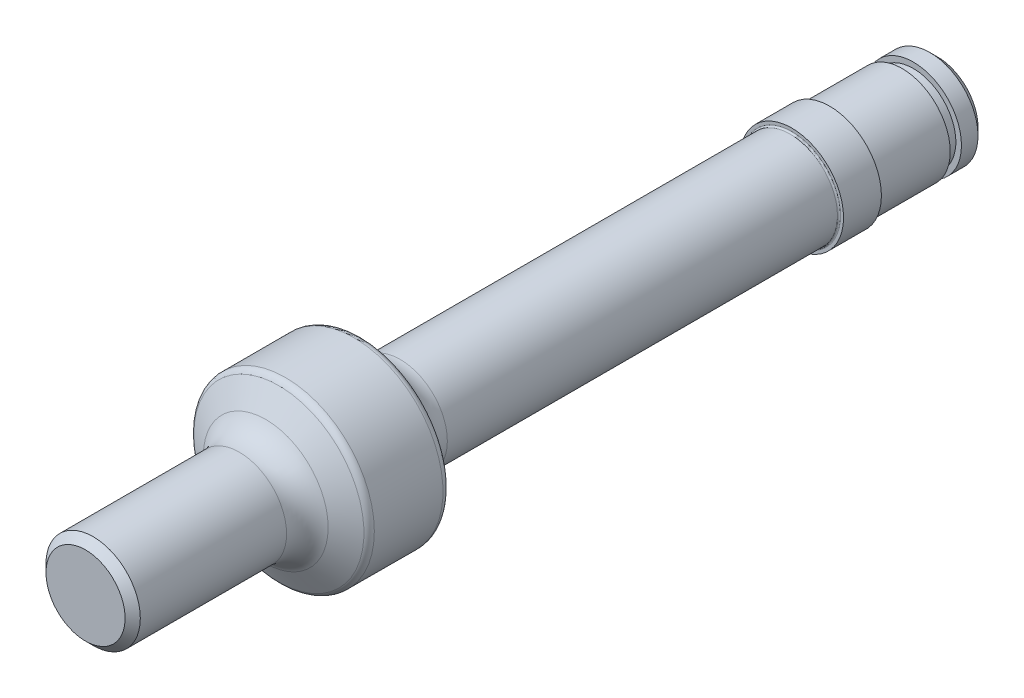
ISO-10303-21;
HEADER;
FILE_DESCRIPTION(('STEP AP214'),'2;1');
FILE_NAME('part.step','',(''),(''),'','','');
FILE_SCHEMA(('AUTOMOTIVE_DESIGN { 1 0 10303 214 1 1 1 1 }'));
ENDSEC;
DATA;
#1=APPLICATION_CONTEXT('core data for automotive mechanical design processes');
#2=APPLICATION_PROTOCOL_DEFINITION('international standard','automotive_design',2000,#1);
#3=PRODUCT_CONTEXT('',#1,'mechanical');
#4=PRODUCT('Part','Part','',(#3));
#5=PRODUCT_RELATED_PRODUCT_CATEGORY('part','',(#4));
#6=PRODUCT_DEFINITION_FORMATION('','',#4);
#7=PRODUCT_DEFINITION_CONTEXT('part definition',#1,'design');
#8=PRODUCT_DEFINITION('design','',#6,#7);
#9=PRODUCT_DEFINITION_SHAPE('','',#8);
#10=(LENGTH_UNIT() NAMED_UNIT(*) SI_UNIT(.MILLI.,.METRE.));
#11=(NAMED_UNIT(*) PLANE_ANGLE_UNIT() SI_UNIT($,.RADIAN.));
#12=(NAMED_UNIT(*) SI_UNIT($,.STERADIAN.) SOLID_ANGLE_UNIT());
#13=UNCERTAINTY_MEASURE_WITH_UNIT(LENGTH_MEASURE(1.E-05),#10,'distance_accuracy_value','');
#14=(GEOMETRIC_REPRESENTATION_CONTEXT(3) GLOBAL_UNCERTAINTY_ASSIGNED_CONTEXT((#13)) GLOBAL_UNIT_ASSIGNED_CONTEXT((#10,
#11,#12)) REPRESENTATION_CONTEXT('',''));
#15=CARTESIAN_POINT('',(0.,0.,0.));
#16=DIRECTION('',(0.,0.,1.));
#17=DIRECTION('',(1.,0.,0.));
#18=AXIS2_PLACEMENT_3D('',#15,#16,#17);
#19=CARTESIAN_POINT('',(0.,3.1623,-40.6019));
#20=DIRECTION('',(0.,0.,1.));
#21=DIRECTION('',(1.,0.,0.));
#22=AXIS2_PLACEMENT_3D('',#19,#20,#21);
#23=PLANE('',#22);
#24=CARTESIAN_POINT('',(0.,0.,-40.6019000000697));
#25=DIRECTION('',(0.,0.,1.));
#26=DIRECTION('',(1.,0.,0.));
#27=AXIS2_PLACEMENT_3D('',#24,#25,#26);
#28=CIRCLE('',#27,2.66229999999723);
#29=CARTESIAN_POINT('',(2.66229999999723,0.,-40.6019000000697));
#30=VERTEX_POINT('',#29);
#31=EDGE_CURVE('E258',#30,#30,#28,.T.);
#32=ORIENTED_EDGE('',*,*,#31,.F.);
#33=EDGE_LOOP('',(#32));
#34=FACE_BOUND('',#33,.T.);
#35=ADVANCED_FACE('F18',(#34),#23,.F.);
#36=CARTESIAN_POINT('',(0.,0.,-40.1019000000247));
#37=DIRECTION('',(0.,0.,1.));
#38=DIRECTION('',(1.,0.,0.));
#39=AXIS2_PLACEMENT_3D('',#36,#37,#38);
#40=CONICAL_SURFACE('',#39,3.16230000004225,0.785398163397448);
#41=ORIENTED_EDGE('',*,*,#31,.T.);
#42=EDGE_LOOP('',(#41));
#43=FACE_BOUND('',#42,.T.);
#44=CARTESIAN_POINT('',(0.,0.,-40.1019));
#45=DIRECTION('',(0.,0.,1.));
#46=DIRECTION('',(1.,0.,0.));
#47=AXIS2_PLACEMENT_3D('',#44,#45,#46);
#48=CIRCLE('',#47,3.1623);
#49=CARTESIAN_POINT('',(3.1623,0.,-40.1019));
#50=VERTEX_POINT('',#49);
#51=EDGE_CURVE('E257',#50,#50,#48,.T.);
#52=ORIENTED_EDGE('',*,*,#51,.F.);
#53=EDGE_LOOP('',(#52));
#54=FACE_BOUND('',#53,.T.);
#55=ADVANCED_FACE('F150',(#43,#54),#40,.T.);
#56=CARTESIAN_POINT('',(0.,0.,26.453846));
#57=DIRECTION('',(0.,0.,1.));
#58=DIRECTION('',(1.,0.,0.));
#59=AXIS2_PLACEMENT_3D('',#56,#57,#58);
#60=CYLINDRICAL_SURFACE('',#59,3.1623);
#61=ORIENTED_EDGE('',*,*,#51,.T.);
#62=EDGE_LOOP('',(#61));
#63=FACE_BOUND('',#62,.T.);
#64=CARTESIAN_POINT('',(0.,0.,-39.0144));
#65=DIRECTION('',(0.,0.,1.));
#66=DIRECTION('',(1.,0.,0.));
#67=AXIS2_PLACEMENT_3D('',#64,#65,#66);
#68=CIRCLE('',#67,3.1623);
#69=CARTESIAN_POINT('',(3.1623,0.,-39.0144));
#70=VERTEX_POINT('',#69);
#71=EDGE_CURVE('E254',#70,#70,#68,.F.);
#72=ORIENTED_EDGE('',*,*,#71,.T.);
#73=EDGE_LOOP('',(#72));
#74=FACE_BOUND('',#73,.T.);
#75=ADVANCED_FACE('F147',(#63,#74),#60,.T.);
#76=CARTESIAN_POINT('',(0.,3.10000000000002,15.3981));
#77=DIRECTION('',(0.,0.,-1.));
#78=DIRECTION('',(-1.,0.,0.));
#79=AXIS2_PLACEMENT_3D('',#76,#77,#78);
#80=PLANE('',#79);
#81=CARTESIAN_POINT('',(0.,0.,15.3980999999703));
#82=DIRECTION('',(0.,0.,-1.));
#83=DIRECTION('',(0.,1.,0.));
#84=AXIS2_PLACEMENT_3D('',#81,#82,#83);
#85=CIRCLE('',#84,2.59999999991578);
#86=CARTESIAN_POINT('',(0.,2.59999999991578,15.3980999999703));
#87=VERTEX_POINT('',#86);
#88=EDGE_CURVE('E251',#87,#87,#85,.T.);
#89=ORIENTED_EDGE('',*,*,#88,.F.);
#90=EDGE_LOOP('',(#89));
#91=FACE_BOUND('',#90,.T.);
#92=ADVANCED_FACE('F143',(#91),#80,.F.);
#93=CARTESIAN_POINT('',(0.,2.794,-39.0144));
#94=DIRECTION('',(0.,0.,-1.));
#95=DIRECTION('',(-1.,0.,0.));
#96=AXIS2_PLACEMENT_3D('',#93,#94,#95);
#97=PLANE('',#96);
#98=CARTESIAN_POINT('',(0.,0.,-39.0144));
#99=DIRECTION('',(0.,0.,-1.));
#100=DIRECTION('',(-1.,0.,0.));
#101=AXIS2_PLACEMENT_3D('',#98,#99,#100);
#102=CIRCLE('',#101,2.794);
#103=CARTESIAN_POINT('',(-2.794,0.,-39.0144));
#104=VERTEX_POINT('',#103);
#105=EDGE_CURVE('E248',#104,#104,#102,.F.);
#106=ORIENTED_EDGE('',*,*,#105,.F.);
#107=EDGE_LOOP('',(#106));
#108=FACE_BOUND('',#107,.T.);
#109=ORIENTED_EDGE('',*,*,#71,.F.);
#110=EDGE_LOOP('',(#109));
#111=FACE_BOUND('',#110,.T.);
#112=ADVANCED_FACE('F139',(#108,#111),#97,.F.);
#113=CARTESIAN_POINT('',(0.,0.,14.8980999999822));
#114=DIRECTION('',(0.,0.,-1.));
#115=DIRECTION('',(0.,1.,0.));
#116=AXIS2_PLACEMENT_3D('',#113,#114,#115);
#117=CONICAL_SURFACE('',#116,3.0999999999608,0.785398163454292);
#118=ORIENTED_EDGE('',*,*,#88,.T.);
#119=EDGE_LOOP('',(#118));
#120=FACE_BOUND('',#119,.T.);
#121=CARTESIAN_POINT('',(0.,0.,14.8981));
#122=DIRECTION('',(0.,0.,1.));
#123=DIRECTION('',(1.,0.,0.));
#124=AXIS2_PLACEMENT_3D('',#121,#122,#123);
#125=CIRCLE('',#124,3.10000000000001);
#126=CARTESIAN_POINT('',(3.10000000000001,0.,14.8981));
#127=VERTEX_POINT('',#126);
#128=EDGE_CURVE('E247',#127,#127,#125,.F.);
#129=ORIENTED_EDGE('',*,*,#128,.F.);
#130=EDGE_LOOP('',(#129));
#131=FACE_BOUND('',#130,.T.);
#132=ADVANCED_FACE('F135',(#120,#131),#117,.T.);
#133=CARTESIAN_POINT('',(0.,0.,-40.0654390361338));
#134=DIRECTION('',(0.,0.,-1.));
#135=DIRECTION('',(-1.,0.,0.));
#136=AXIS2_PLACEMENT_3D('',#133,#134,#135);
#137=CYLINDRICAL_SURFACE('',#136,2.794);
#138=ORIENTED_EDGE('',*,*,#105,.T.);
#139=EDGE_LOOP('',(#138));
#140=FACE_BOUND('',#139,.T.);
#141=CARTESIAN_POINT('',(0.,0.,-38.2778));
#142=DIRECTION('',(0.,0.,-1.));
#143=DIRECTION('',(-1.,0.,0.));
#144=AXIS2_PLACEMENT_3D('',#141,#142,#143);
#145=CIRCLE('',#144,2.794);
#146=CARTESIAN_POINT('',(-2.794,0.,-38.2778));
#147=VERTEX_POINT('',#146);
#148=EDGE_CURVE('E244',#147,#147,#145,.T.);
#149=ORIENTED_EDGE('',*,*,#148,.T.);
#150=EDGE_LOOP('',(#149));
#151=FACE_BOUND('',#150,.T.);
#152=ADVANCED_FACE('F131',(#140,#151),#137,.T.);
#153=CARTESIAN_POINT('',(0.,0.,26.453846));
#154=DIRECTION('',(0.,0.,1.));
#155=DIRECTION('',(1.,0.,0.));
#156=AXIS2_PLACEMENT_3D('',#153,#154,#155);
#157=CYLINDRICAL_SURFACE('',#156,3.10000000000001);
#158=CARTESIAN_POINT('',(0.,0.,5.28374149423676));
#159=DIRECTION('',(0.,0.,1.));
#160=DIRECTION('',(1.,0.,0.));
#161=AXIS2_PLACEMENT_3D('',#158,#159,#160);
#162=CIRCLE('',#161,3.10000000000001);
#163=CARTESIAN_POINT('',(3.10000000000001,0.,5.28374149423676));
#164=VERTEX_POINT('',#163);
#165=EDGE_CURVE('E116',#164,#164,#162,.T.);
#166=ORIENTED_EDGE('',*,*,#165,.T.);
#167=EDGE_LOOP('',(#166));
#168=FACE_BOUND('',#167,.T.);
#169=ORIENTED_EDGE('',*,*,#128,.T.);
#170=EDGE_LOOP('',(#169));
#171=FACE_BOUND('',#170,.T.);
#172=ADVANCED_FACE('F127',(#168,#171),#157,.T.);
#173=CARTESIAN_POINT('',(0.,2.794,-38.2778));
#174=DIRECTION('',(0.,0.,1.));
#175=DIRECTION('',(1.,0.,0.));
#176=AXIS2_PLACEMENT_3D('',#173,#174,#175);
#177=PLANE('',#176);
#178=CARTESIAN_POINT('',(0.,0.,-38.2778));
#179=DIRECTION('',(0.,0.,1.));
#180=DIRECTION('',(1.,0.,0.));
#181=AXIS2_PLACEMENT_3D('',#178,#179,#180);
#182=CIRCLE('',#181,3.1623);
#183=CARTESIAN_POINT('',(3.1623,0.,-38.2778));
#184=VERTEX_POINT('',#183);
#185=EDGE_CURVE('E111',#184,#184,#182,.T.);
#186=ORIENTED_EDGE('',*,*,#185,.F.);
#187=EDGE_LOOP('',(#186));
#188=FACE_BOUND('',#187,.T.);
#189=ORIENTED_EDGE('',*,*,#148,.F.);
#190=EDGE_LOOP('',(#189));
#191=FACE_BOUND('',#190,.T.);
#192=ADVANCED_FACE('F123',(#188,#191),#177,.F.);
#193=CARTESIAN_POINT('',(0.,0.,5.28374149423676));
#194=DIRECTION('',(0.,0.,1.));
#195=DIRECTION('',(1.,0.,0.));
#196=AXIS2_PLACEMENT_3D('',#193,#194,#195);
#197=TOROIDAL_SURFACE('',#196,5.10000000000001,2.);
#198=CARTESIAN_POINT('',(0.,0.,3.55169068666328));
#199=DIRECTION('',(0.,0.,-1.));
#200=DIRECTION('',(-1.,0.,0.));
#201=AXIS2_PLACEMENT_3D('',#198,#199,#200);
#202=CIRCLE('',#201,4.099999999994);
#203=CARTESIAN_POINT('',(-4.099999999994,0.,3.55169068666328));
#204=VERTEX_POINT('',#203);
#205=EDGE_CURVE('E103',#204,#204,#202,.T.);
#206=ORIENTED_EDGE('',*,*,#205,.F.);
#207=EDGE_LOOP('',(#206));
#208=FACE_BOUND('',#207,.T.);
#209=ORIENTED_EDGE('',*,*,#165,.F.);
#210=EDGE_LOOP('',(#209));
#211=FACE_BOUND('',#210,.T.);
#212=ADVANCED_FACE('F119',(#208,#211),#197,.F.);
#213=CARTESIAN_POINT('',(0.,0.,26.453846));
#214=DIRECTION('',(0.,0.,1.));
#215=DIRECTION('',(1.,0.,0.));
#216=AXIS2_PLACEMENT_3D('',#213,#214,#215);
#217=CYLINDRICAL_SURFACE('',#216,3.1623);
#218=CARTESIAN_POINT('',(0.,0.,-33.6153));
#219=DIRECTION('',(0.,0.,1.));
#220=DIRECTION('',(1.,0.,0.));
#221=AXIS2_PLACEMENT_3D('',#218,#219,#220);
#222=CIRCLE('',#221,3.1623);
#223=CARTESIAN_POINT('',(3.1623,0.,-33.6153));
#224=VERTEX_POINT('',#223);
#225=EDGE_CURVE('E92',#224,#224,#222,.F.);
#226=ORIENTED_EDGE('',*,*,#225,.T.);
#227=EDGE_LOOP('',(#226));
#228=FACE_BOUND('',#227,.T.);
#229=ORIENTED_EDGE('',*,*,#185,.T.);
#230=EDGE_LOOP('',(#229));
#231=FACE_BOUND('',#230,.T.);
#232=ADVANCED_FACE('F122',(#228,#231),#217,.T.);
#233=CARTESIAN_POINT('',(0.,0.,2.69028408501981));
#234=DIRECTION('',(0.,0.,-1.));
#235=DIRECTION('',(-1.,0.,0.));
#236=AXIS2_PLACEMENT_3D('',#233,#234,#235);
#237=CONICAL_SURFACE('',#236,5.59199999997873,1.04719755118586);
#238=ORIENTED_EDGE('',*,*,#205,.T.);
#239=EDGE_LOOP('',(#238));
#240=FACE_BOUND('',#239,.T.);
#241=CARTESIAN_POINT('',(0.,0.,2.69028408503697));
#242=DIRECTION('',(0.,0.,-1.));
#243=DIRECTION('',(-1.,0.,0.));
#244=AXIS2_PLACEMENT_3D('',#241,#242,#243);
#245=CIRCLE('',#244,5.59199999999999);
#246=CARTESIAN_POINT('',(-5.59199999999999,0.,2.69028408503697));
#247=VERTEX_POINT('',#246);
#248=EDGE_CURVE('E59',#247,#247,#245,.T.);
#249=ORIENTED_EDGE('',*,*,#248,.F.);
#250=EDGE_LOOP('',(#249));
#251=FACE_BOUND('',#250,.T.);
#252=ADVANCED_FACE('F97',(#240,#251),#237,.T.);
#253=CARTESIAN_POINT('',(0.,0.,-33.6153));
#254=DIRECTION('',(0.,0.,1.));
#255=DIRECTION('',(1.,0.,0.));
#256=AXIS2_PLACEMENT_3D('',#253,#254,#255);
#257=TOROIDAL_SURFACE('',#256,3.2623,0.1);
#258=CARTESIAN_POINT('',(0.,0.,-33.5153));
#259=DIRECTION('',(0.,0.,-1.));
#260=DIRECTION('',(-1.,0.,0.));
#261=AXIS2_PLACEMENT_3D('',#258,#259,#260);
#262=CIRCLE('',#261,3.2623);
#263=CARTESIAN_POINT('',(-3.2623,0.,-33.5153));
#264=VERTEX_POINT('',#263);
#265=CARTESIAN_POINT('',(3.2623,0.,-33.5153));
#266=VERTEX_POINT('',#265);
#267=EDGE_CURVE('E48',#264,#266,#262,.T.);
#268=ORIENTED_EDGE('',*,*,#267,.T.);
#269=CARTESIAN_POINT('',(0.,0.,-33.5153));
#270=DIRECTION('',(0.,0.,-1.));
#271=DIRECTION('',(1.,0.,0.));
#272=AXIS2_PLACEMENT_3D('',#269,#270,#271);
#273=CIRCLE('',#272,3.2623);
#274=EDGE_CURVE('E46',#266,#264,#273,.T.);
#275=ORIENTED_EDGE('',*,*,#274,.T.);
#276=EDGE_LOOP('',(#268,#275));
#277=FACE_BOUND('',#276,.T.);
#278=ORIENTED_EDGE('',*,*,#225,.F.);
#279=EDGE_LOOP('',(#278));
#280=FACE_BOUND('',#279,.T.);
#281=ADVANCED_FACE('F50',(#277,#280),#257,.F.);
#282=CARTESIAN_POINT('',(0.,0.,2.25727138314476));
#283=DIRECTION('',(0.,0.,-1.));
#284=DIRECTION('',(-1.,0.,0.));
#285=AXIS2_PLACEMENT_3D('',#282,#283,#284);
#286=TOROIDAL_SURFACE('',#285,5.34199999999999,0.5);
#287=ORIENTED_EDGE('',*,*,#248,.T.);
#288=EDGE_LOOP('',(#287));
#289=FACE_BOUND('',#288,.T.);
#290=CARTESIAN_POINT('',(0.,0.,2.25727138314476));
#291=DIRECTION('',(0.,0.,1.));
#292=DIRECTION('',(1.,0.,0.));
#293=AXIS2_PLACEMENT_3D('',#290,#291,#292);
#294=CIRCLE('',#293,5.842);
#295=CARTESIAN_POINT('',(5.842,0.,2.25727138314476));
#296=VERTEX_POINT('',#295);
#297=EDGE_CURVE('E54',#296,#296,#294,.F.);
#298=ORIENTED_EDGE('',*,*,#297,.F.);
#299=EDGE_LOOP('',(#298));
#300=FACE_BOUND('',#299,.T.);
#301=ADVANCED_FACE('F77',(#289,#300),#286,.T.);
#302=CARTESIAN_POINT('',(0.,3.4,-33.5153));
#303=DIRECTION('',(0.,0.,1.));
#304=DIRECTION('',(1.,0.,0.));
#305=AXIS2_PLACEMENT_3D('',#302,#303,#304);
#306=PLANE('',#305);
#307=CARTESIAN_POINT('',(0.,0.,-33.5153));
#308=DIRECTION('',(0.,0.,1.));
#309=DIRECTION('',(1.,0.,0.));
#310=AXIS2_PLACEMENT_3D('',#307,#308,#309);
#311=CIRCLE('',#310,3.4);
#312=CARTESIAN_POINT('',(3.4,0.,-33.5153));
#313=VERTEX_POINT('',#312);
#314=EDGE_CURVE('E230',#313,#313,#311,.T.);
#315=ORIENTED_EDGE('',*,*,#314,.F.);
#316=EDGE_LOOP('',(#315));
#317=FACE_BOUND('',#316,.T.);
#318=ORIENTED_EDGE('',*,*,#274,.F.);
#319=ORIENTED_EDGE('',*,*,#267,.F.);
#320=EDGE_LOOP('',(#318,#319));
#321=FACE_BOUND('',#320,.T.);
#322=ADVANCED_FACE('F58',(#317,#321),#306,.F.);
#323=CARTESIAN_POINT('',(0.,0.,26.453846));
#324=DIRECTION('',(0.,0.,1.));
#325=DIRECTION('',(1.,0.,0.));
#326=AXIS2_PLACEMENT_3D('',#323,#324,#325);
#327=CYLINDRICAL_SURFACE('',#326,5.842);
#328=CARTESIAN_POINT('',(0.,0.,-2.25727138314476));
#329=DIRECTION('',(0.,0.,-1.));
#330=DIRECTION('',(-1.,0.,0.));
#331=AXIS2_PLACEMENT_3D('',#328,#329,#330);
#332=CIRCLE('',#331,5.842);
#333=CARTESIAN_POINT('',(-5.842,0.,-2.25727138314476));
#334=VERTEX_POINT('',#333);
#335=EDGE_CURVE('E227',#334,#334,#332,.T.);
#336=ORIENTED_EDGE('',*,*,#335,.F.);
#337=EDGE_LOOP('',(#336));
#338=FACE_BOUND('',#337,.T.);
#339=ORIENTED_EDGE('',*,*,#297,.T.);
#340=EDGE_LOOP('',(#339));
#341=FACE_BOUND('',#340,.T.);
#342=ADVANCED_FACE('F76',(#338,#341),#327,.T.);
#343=CARTESIAN_POINT('',(0.,0.,26.453846));
#344=DIRECTION('',(0.,0.,1.));
#345=DIRECTION('',(1.,0.,0.));
#346=AXIS2_PLACEMENT_3D('',#343,#344,#345);
#347=CYLINDRICAL_SURFACE('',#346,3.4);
#348=CARTESIAN_POINT('',(0.,0.,-31.0261));
#349=DIRECTION('',(0.,0.,1.));
#350=DIRECTION('',(1.,0.,0.));
#351=AXIS2_PLACEMENT_3D('',#348,#349,#350);
#352=CIRCLE('',#351,3.4);
#353=CARTESIAN_POINT('',(3.4,0.,-31.0261));
#354=VERTEX_POINT('',#353);
#355=EDGE_CURVE('E229',#354,#354,#352,.F.);
#356=ORIENTED_EDGE('',*,*,#355,.T.);
#357=EDGE_LOOP('',(#356));
#358=FACE_BOUND('',#357,.T.);
#359=ORIENTED_EDGE('',*,*,#314,.T.);
#360=EDGE_LOOP('',(#359));
#361=FACE_BOUND('',#360,.T.);
#362=ADVANCED_FACE('F282',(#358,#361),#347,.T.);
#363=CARTESIAN_POINT('',(0.,0.,-2.25727138314476));
#364=DIRECTION('',(0.,0.,-1.));
#365=DIRECTION('',(-1.,0.,0.));
#366=AXIS2_PLACEMENT_3D('',#363,#364,#365);
#367=TOROIDAL_SURFACE('',#366,5.34199999999999,0.5);
#368=ORIENTED_EDGE('',*,*,#335,.T.);
#369=EDGE_LOOP('',(#368));
#370=FACE_BOUND('',#369,.T.);
#371=CARTESIAN_POINT('',(0.,0.,-2.69028408501981));
#372=DIRECTION('',(0.,0.,1.));
#373=DIRECTION('',(1.,0.,0.));
#374=AXIS2_PLACEMENT_3D('',#371,#372,#373);
#375=CIRCLE('',#374,5.59199999997873);
#376=CARTESIAN_POINT('',(5.59199999997872,0.,-2.69028408501981));
#377=VERTEX_POINT('',#376);
#378=EDGE_CURVE('E186',#377,#377,#375,.F.);
#379=ORIENTED_EDGE('',*,*,#378,.F.);
#380=EDGE_LOOP('',(#379));
#381=FACE_BOUND('',#380,.T.);
#382=ADVANCED_FACE('F204',(#370,#381),#367,.T.);
#383=CARTESIAN_POINT('',(0.,3.4,-31.0261));
#384=DIRECTION('',(0.,0.,-1.));
#385=DIRECTION('',(-1.,0.,0.));
#386=AXIS2_PLACEMENT_3D('',#383,#384,#385);
#387=PLANE('',#386);
#388=ORIENTED_EDGE('',*,*,#355,.F.);
#389=EDGE_LOOP('',(#388));
#390=FACE_BOUND('',#389,.T.);
#391=CARTESIAN_POINT('',(0.,0.,-31.0261));
#392=DIRECTION('',(0.,0.,1.));
#393=DIRECTION('',(-1.,0.,0.));
#394=AXIS2_PLACEMENT_3D('',#391,#392,#393);
#395=CIRCLE('',#394,3.19999999999995);
#396=CARTESIAN_POINT('',(3.19999999999995,0.,-31.0261));
#397=VERTEX_POINT('',#396);
#398=CARTESIAN_POINT('',(-3.19999999999995,0.,-31.0261));
#399=VERTEX_POINT('',#398);
#400=EDGE_CURVE('E183',#397,#399,#395,.F.);
#401=ORIENTED_EDGE('',*,*,#400,.T.);
#402=CARTESIAN_POINT('',(0.,0.,-31.0261));
#403=DIRECTION('',(0.,0.,1.));
#404=DIRECTION('',(1.,0.,0.));
#405=AXIS2_PLACEMENT_3D('',#402,#403,#404);
#406=CIRCLE('',#405,3.19999999999995);
#407=EDGE_CURVE('E37',#399,#397,#406,.F.);
#408=ORIENTED_EDGE('',*,*,#407,.T.);
#409=EDGE_LOOP('',(#401,#408));
#410=FACE_BOUND('',#409,.T.);
#411=ADVANCED_FACE('F194',(#390,#410),#387,.F.);
#412=CARTESIAN_POINT('',(0.,0.,-2.69028408507666));
#413=DIRECTION('',(0.,0.,1.));
#414=DIRECTION('',(1.,0.,0.));
#415=AXIS2_PLACEMENT_3D('',#412,#413,#414);
#416=CONICAL_SURFACE('',#415,5.59199999992188,1.04719755119794);
#417=CARTESIAN_POINT('',(0.,0.,-3.55169068666792));
#418=DIRECTION('',(0.,0.,1.));
#419=DIRECTION('',(1.,0.,0.));
#420=AXIS2_PLACEMENT_3D('',#417,#418,#419);
#421=CIRCLE('',#420,4.09999999999995);
#422=CARTESIAN_POINT('',(4.09999999999995,0.,-3.55169068666792));
#423=VERTEX_POINT('',#422);
#424=EDGE_CURVE('E181',#423,#423,#421,.T.);
#425=ORIENTED_EDGE('',*,*,#424,.T.);
#426=EDGE_LOOP('',(#425));
#427=FACE_BOUND('',#426,.T.);
#428=ORIENTED_EDGE('',*,*,#378,.T.);
#429=EDGE_LOOP('',(#428));
#430=FACE_BOUND('',#429,.T.);
#431=ADVANCED_FACE('F203',(#427,#430),#416,.T.);
#432=CARTESIAN_POINT('',(0.,0.,-30.9261));
#433=DIRECTION('',(0.,0.,-1.));
#434=DIRECTION('',(-1.,0.,0.));
#435=AXIS2_PLACEMENT_3D('',#432,#433,#434);
#436=TOROIDAL_SURFACE('',#435,3.19999999999995,0.1);
#437=CARTESIAN_POINT('',(0.,0.,-30.9261));
#438=DIRECTION('',(0.,0.,1.));
#439=DIRECTION('',(1.,0.,0.));
#440=AXIS2_PLACEMENT_3D('',#437,#438,#439);
#441=CIRCLE('',#440,3.09999999999995);
#442=CARTESIAN_POINT('',(3.09999999999995,0.,-30.9261));
#443=VERTEX_POINT('',#442);
#444=EDGE_CURVE('E29',#443,#443,#441,.T.);
#445=ORIENTED_EDGE('',*,*,#444,.F.);
#446=EDGE_LOOP('',(#445));
#447=FACE_BOUND('',#446,.T.);
#448=ORIENTED_EDGE('',*,*,#400,.F.);
#449=ORIENTED_EDGE('',*,*,#407,.F.);
#450=EDGE_LOOP('',(#448,#449));
#451=FACE_BOUND('',#450,.T.);
#452=ADVANCED_FACE('F169',(#447,#451),#436,.F.);
#453=CARTESIAN_POINT('',(0.,0.,-5.2837414942368));
#454=DIRECTION('',(0.,0.,1.));
#455=DIRECTION('',(1.,0.,0.));
#456=AXIS2_PLACEMENT_3D('',#453,#454,#455);
#457=TOROIDAL_SURFACE('',#456,5.09999999999995,2.);
#458=CARTESIAN_POINT('',(0.,0.,-5.2837414942368));
#459=DIRECTION('',(0.,0.,1.));
#460=DIRECTION('',(1.,0.,0.));
#461=AXIS2_PLACEMENT_3D('',#458,#459,#460);
#462=CIRCLE('',#461,3.09999999999995);
#463=CARTESIAN_POINT('',(3.09999999999995,0.,-5.2837414942368));
#464=VERTEX_POINT('',#463);
#465=EDGE_CURVE('E11',#464,#464,#462,.F.);
#466=ORIENTED_EDGE('',*,*,#465,.F.);
#467=EDGE_LOOP('',(#466));
#468=FACE_BOUND('',#467,.T.);
#469=ORIENTED_EDGE('',*,*,#424,.F.);
#470=EDGE_LOOP('',(#469));
#471=FACE_BOUND('',#470,.T.);
#472=ADVANCED_FACE('F163',(#468,#471),#457,.F.);
#473=CARTESIAN_POINT('',(0.,0.,26.453846));
#474=DIRECTION('',(0.,0.,1.));
#475=DIRECTION('',(1.,0.,0.));
#476=AXIS2_PLACEMENT_3D('',#473,#474,#475);
#477=CYLINDRICAL_SURFACE('',#476,3.09999999999995);
#478=ORIENTED_EDGE('',*,*,#444,.T.);
#479=EDGE_LOOP('',(#478));
#480=FACE_BOUND('',#479,.T.);
#481=ORIENTED_EDGE('',*,*,#465,.T.);
#482=EDGE_LOOP('',(#481));
#483=FACE_BOUND('',#482,.T.);
#484=ADVANCED_FACE('F161',(#480,#483),#477,.T.);
#485=CLOSED_SHELL('',(#35,#55,#75,#92,#112,#132,#152,#172,#192,#212,#232,#252,#281,#301,#322,
#342,#362,#382,#411,#431,#452,#472,#484));
#486=MANIFOLD_SOLID_BREP('B1',#485);
#487=ADVANCED_BREP_SHAPE_REPRESENTATION('',(#18,#486),#14);
#488=SHAPE_DEFINITION_REPRESENTATION(#9,#487);
ENDSEC;
END-ISO-10303-21;
